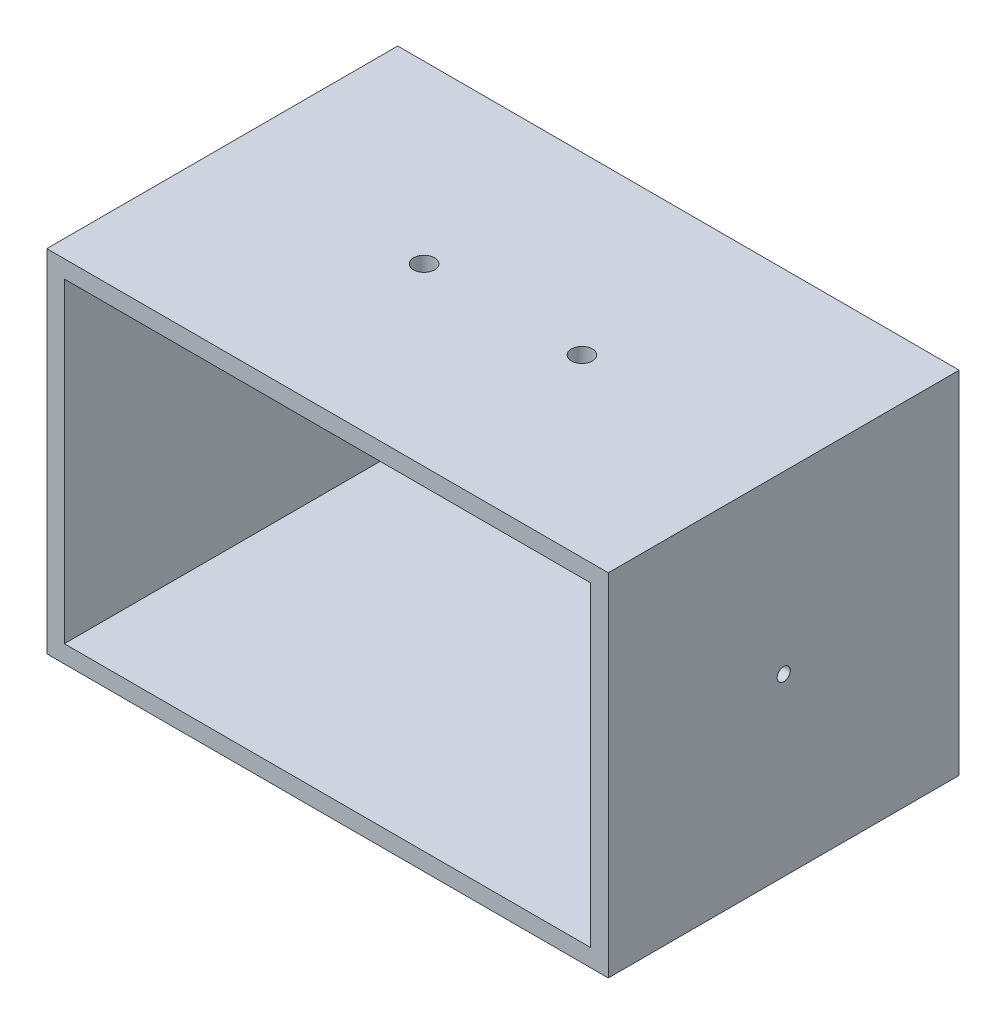
ISO-10303-21;
HEADER;
FILE_DESCRIPTION(('STEP AP214'),'2;1');
FILE_NAME('part.step','',(''),(''),'','','');
FILE_SCHEMA(('AUTOMOTIVE_DESIGN { 1 0 10303 214 1 1 1 1 }'));
ENDSEC;
DATA;
#1=APPLICATION_CONTEXT('core data for automotive mechanical design processes');
#2=APPLICATION_PROTOCOL_DEFINITION('international standard','automotive_design',2000,#1);
#3=PRODUCT_CONTEXT('',#1,'mechanical');
#4=PRODUCT('Part','Part','',(#3));
#5=PRODUCT_RELATED_PRODUCT_CATEGORY('part','',(#4));
#6=PRODUCT_DEFINITION_FORMATION('','',#4);
#7=PRODUCT_DEFINITION_CONTEXT('part definition',#1,'design');
#8=PRODUCT_DEFINITION('design','',#6,#7);
#9=PRODUCT_DEFINITION_SHAPE('','',#8);
#10=(LENGTH_UNIT() NAMED_UNIT(*) SI_UNIT(.MILLI.,.METRE.));
#11=(NAMED_UNIT(*) PLANE_ANGLE_UNIT() SI_UNIT($,.RADIAN.));
#12=(NAMED_UNIT(*) SI_UNIT($,.STERADIAN.) SOLID_ANGLE_UNIT());
#13=UNCERTAINTY_MEASURE_WITH_UNIT(LENGTH_MEASURE(1.E-05),#10,'distance_accuracy_value','');
#14=(GEOMETRIC_REPRESENTATION_CONTEXT(3) GLOBAL_UNCERTAINTY_ASSIGNED_CONTEXT((#13)) GLOBAL_UNIT_ASSIGNED_CONTEXT((#10,
#11,#12)) REPRESENTATION_CONTEXT('',''));
#15=CARTESIAN_POINT('',(0.,0.,0.));
#16=DIRECTION('',(0.,0.,1.));
#17=DIRECTION('',(1.,0.,0.));
#18=AXIS2_PLACEMENT_3D('',#15,#16,#17);
#19=CARTESIAN_POINT('',(0.,127.,0.));
#20=DIRECTION('',(0.,0.,-1.));
#21=DIRECTION('',(-1.,0.,0.));
#22=AXIS2_PLACEMENT_3D('',#19,#20,#21);
#23=PLANE('',#22);
#24=DIRECTION('',(1.,0.,0.));
#25=VECTOR('',#24,1.);
#26=CARTESIAN_POINT('',(0.,0.,0.));
#27=LINE('',#26,#25);
#28=CARTESIAN_POINT('',(0.,0.,0.));
#29=VERTEX_POINT('',#28);
#30=CARTESIAN_POINT('',(203.2,0.,0.));
#31=VERTEX_POINT('',#30);
#32=EDGE_CURVE('E167',#29,#31,#27,.T.);
#33=ORIENTED_EDGE('',*,*,#32,.T.);
#34=DIRECTION('',(0.,-1.,0.));
#35=VECTOR('',#34,1.);
#36=CARTESIAN_POINT('',(203.2,127.,0.));
#37=LINE('',#36,#35);
#38=CARTESIAN_POINT('',(203.2,127.,0.));
#39=VERTEX_POINT('',#38);
#40=EDGE_CURVE('E46',#39,#31,#37,.T.);
#41=ORIENTED_EDGE('',*,*,#40,.F.);
#42=DIRECTION('',(1.,0.,0.));
#43=VECTOR('',#42,1.);
#44=CARTESIAN_POINT('',(0.,127.,0.));
#45=LINE('',#44,#43);
#46=CARTESIAN_POINT('',(0.,127.,0.));
#47=VERTEX_POINT('',#46);
#48=EDGE_CURVE('E91',#47,#39,#45,.T.);
#49=ORIENTED_EDGE('',*,*,#48,.F.);
#50=DIRECTION('',(0.,-1.,0.));
#51=VECTOR('',#50,1.);
#52=CARTESIAN_POINT('',(0.,127.,0.));
#53=LINE('',#52,#51);
#54=EDGE_CURVE('E11',#47,#29,#53,.T.);
#55=ORIENTED_EDGE('',*,*,#54,.T.);
#56=EDGE_LOOP('',(#33,#41,#49,#55));
#57=FACE_BOUND('',#56,.T.);
#58=DIRECTION('',(1.,0.,0.));
#59=VECTOR('',#58,1.);
#60=CARTESIAN_POINT('',(0.,6.35,0.));
#61=LINE('',#60,#59);
#62=CARTESIAN_POINT('',(6.35,6.35,0.));
#63=VERTEX_POINT('',#62);
#64=CARTESIAN_POINT('',(196.85,6.35,0.));
#65=VERTEX_POINT('',#64);
#66=EDGE_CURVE('E135',#63,#65,#61,.T.);
#67=ORIENTED_EDGE('',*,*,#66,.F.);
#68=DIRECTION('',(0.,-1.,0.));
#69=VECTOR('',#68,1.);
#70=CARTESIAN_POINT('',(6.35,127.,0.));
#71=LINE('',#70,#69);
#72=CARTESIAN_POINT('',(6.35,120.65,0.));
#73=VERTEX_POINT('',#72);
#74=EDGE_CURVE('E134',#73,#63,#71,.T.);
#75=ORIENTED_EDGE('',*,*,#74,.F.);
#76=DIRECTION('',(1.,0.,0.));
#77=VECTOR('',#76,1.);
#78=CARTESIAN_POINT('',(0.,120.65,0.));
#79=LINE('',#78,#77);
#80=CARTESIAN_POINT('',(196.85,120.65,0.));
#81=VERTEX_POINT('',#80);
#82=EDGE_CURVE('E144',#73,#81,#79,.T.);
#83=ORIENTED_EDGE('',*,*,#82,.T.);
#84=DIRECTION('',(0.,-1.,0.));
#85=VECTOR('',#84,1.);
#86=CARTESIAN_POINT('',(196.85,127.,0.));
#87=LINE('',#86,#85);
#88=EDGE_CURVE('E149',#81,#65,#87,.T.);
#89=ORIENTED_EDGE('',*,*,#88,.T.);
#90=EDGE_LOOP('',(#67,#75,#83,#89));
#91=FACE_BOUND('',#90,.T.);
#92=ADVANCED_FACE('F37',(#57,#91),#23,.F.);
#93=CARTESIAN_POINT('',(0.,127.,0.));
#94=DIRECTION('',(1.,0.,0.));
#95=DIRECTION('',(0.,0.,-1.));
#96=AXIS2_PLACEMENT_3D('',#93,#94,#95);
#97=PLANE('',#96);
#98=CARTESIAN_POINT('',(0.,63.5,-63.5));
#99=DIRECTION('',(1.,0.,0.));
#100=DIRECTION('',(0.,0.,-1.));
#101=AXIS2_PLACEMENT_3D('',#98,#99,#100);
#102=CIRCLE('',#101,2.38125);
#103=CARTESIAN_POINT('',(0.,63.5,-65.88125));
#104=VERTEX_POINT('',#103);
#105=EDGE_CURVE('E178',#104,#104,#102,.T.);
#106=ORIENTED_EDGE('',*,*,#105,.T.);
#107=EDGE_LOOP('',(#106));
#108=FACE_BOUND('',#107,.T.);
#109=DIRECTION('',(0.,0.,1.));
#110=VECTOR('',#109,1.);
#111=CARTESIAN_POINT('',(0.,0.,0.));
#112=LINE('',#111,#110);
#113=CARTESIAN_POINT('',(0.,0.,-127.));
#114=VERTEX_POINT('',#113);
#115=EDGE_CURVE('E152',#114,#29,#112,.T.);
#116=ORIENTED_EDGE('',*,*,#115,.T.);
#117=ORIENTED_EDGE('',*,*,#54,.F.);
#118=DIRECTION('',(0.,0.,1.));
#119=VECTOR('',#118,1.);
#120=CARTESIAN_POINT('',(0.,127.,0.));
#121=LINE('',#120,#119);
#122=CARTESIAN_POINT('',(0.,127.,-127.));
#123=VERTEX_POINT('',#122);
#124=EDGE_CURVE('E158',#123,#47,#121,.T.);
#125=ORIENTED_EDGE('',*,*,#124,.F.);
#126=DIRECTION('',(0.,-1.,0.));
#127=VECTOR('',#126,1.);
#128=CARTESIAN_POINT('',(0.,127.,-127.));
#129=LINE('',#128,#127);
#130=EDGE_CURVE('E164',#123,#114,#129,.T.);
#131=ORIENTED_EDGE('',*,*,#130,.T.);
#132=EDGE_LOOP('',(#116,#117,#125,#131));
#133=FACE_BOUND('',#132,.T.);
#134=ADVANCED_FACE('F39',(#108,#133),#97,.F.);
#135=CARTESIAN_POINT('',(203.2,127.,0.));
#136=DIRECTION('',(-1.,0.,0.));
#137=DIRECTION('',(0.,0.,1.));
#138=AXIS2_PLACEMENT_3D('',#135,#136,#137);
#139=PLANE('',#138);
#140=CARTESIAN_POINT('',(203.2,63.5,-63.5));
#141=DIRECTION('',(1.,0.,0.));
#142=DIRECTION('',(0.,0.,-1.));
#143=AXIS2_PLACEMENT_3D('',#140,#141,#142);
#144=CIRCLE('',#143,2.38125);
#145=CARTESIAN_POINT('',(203.2,63.5,-65.88125));
#146=VERTEX_POINT('',#145);
#147=EDGE_CURVE('E185',#146,#146,#144,.T.);
#148=ORIENTED_EDGE('',*,*,#147,.F.);
#149=EDGE_LOOP('',(#148));
#150=FACE_BOUND('',#149,.T.);
#151=DIRECTION('',(0.,0.,-1.));
#152=VECTOR('',#151,1.);
#153=CARTESIAN_POINT('',(203.2,0.,0.));
#154=LINE('',#153,#152);
#155=CARTESIAN_POINT('',(203.2,0.,-127.));
#156=VERTEX_POINT('',#155);
#157=EDGE_CURVE('E169',#31,#156,#154,.T.);
#158=ORIENTED_EDGE('',*,*,#157,.T.);
#159=DIRECTION('',(0.,-1.,0.));
#160=VECTOR('',#159,1.);
#161=CARTESIAN_POINT('',(203.2,127.,-127.));
#162=LINE('',#161,#160);
#163=CARTESIAN_POINT('',(203.2,127.,-127.));
#164=VERTEX_POINT('',#163);
#165=EDGE_CURVE('E173',#164,#156,#162,.T.);
#166=ORIENTED_EDGE('',*,*,#165,.F.);
#167=DIRECTION('',(0.,0.,-1.));
#168=VECTOR('',#167,1.);
#169=CARTESIAN_POINT('',(203.2,127.,0.));
#170=LINE('',#169,#168);
#171=EDGE_CURVE('E161',#39,#164,#170,.T.);
#172=ORIENTED_EDGE('',*,*,#171,.F.);
#173=ORIENTED_EDGE('',*,*,#40,.T.);
#174=EDGE_LOOP('',(#158,#166,#172,#173));
#175=FACE_BOUND('',#174,.T.);
#176=ADVANCED_FACE('F200',(#150,#175),#139,.F.);
#177=CARTESIAN_POINT('',(0.,127.,-127.));
#178=DIRECTION('',(0.,0.,1.));
#179=DIRECTION('',(1.,0.,0.));
#180=AXIS2_PLACEMENT_3D('',#177,#178,#179);
#181=PLANE('',#180);
#182=DIRECTION('',(-1.,0.,0.));
#183=VECTOR('',#182,1.);
#184=CARTESIAN_POINT('',(0.,0.,-127.));
#185=LINE('',#184,#183);
#186=EDGE_CURVE('E84',#156,#114,#185,.T.);
#187=ORIENTED_EDGE('',*,*,#186,.T.);
#188=ORIENTED_EDGE('',*,*,#130,.F.);
#189=DIRECTION('',(-1.,0.,0.));
#190=VECTOR('',#189,1.);
#191=CARTESIAN_POINT('',(0.,127.,-127.));
#192=LINE('',#191,#190);
#193=EDGE_CURVE('E63',#164,#123,#192,.T.);
#194=ORIENTED_EDGE('',*,*,#193,.F.);
#195=ORIENTED_EDGE('',*,*,#165,.T.);
#196=EDGE_LOOP('',(#187,#188,#194,#195));
#197=FACE_BOUND('',#196,.T.);
#198=ADVANCED_FACE('F203',(#197),#181,.F.);
#199=CARTESIAN_POINT('',(0.,127.,0.));
#200=DIRECTION('',(0.,-1.,0.));
#201=DIRECTION('',(0.,0.,-1.));
#202=AXIS2_PLACEMENT_3D('',#199,#200,#201);
#203=PLANE('',#202);
#204=CARTESIAN_POINT('',(130.162737699088,127.,-63.5));
#205=DIRECTION('',(0.,1.,0.));
#206=DIRECTION('',(0.,0.,1.));
#207=AXIS2_PLACEMENT_3D('',#204,#205,#206);
#208=CIRCLE('',#207,3.79431201906751);
#209=CARTESIAN_POINT('',(130.162737699088,127.,-59.7056879809325));
#210=VERTEX_POINT('',#209);
#211=EDGE_CURVE('E181',#210,#210,#208,.T.);
#212=ORIENTED_EDGE('',*,*,#211,.F.);
#213=EDGE_LOOP('',(#212));
#214=FACE_BOUND('',#213,.T.);
#215=CARTESIAN_POINT('',(73.0372623009117,127.,-63.5));
#216=DIRECTION('',(0.,1.,0.));
#217=DIRECTION('',(0.,0.,1.));
#218=AXIS2_PLACEMENT_3D('',#215,#216,#217);
#219=CIRCLE('',#218,3.79431201906753);
#220=CARTESIAN_POINT('',(73.0372623009117,127.,-59.7056879809325));
#221=VERTEX_POINT('',#220);
#222=EDGE_CURVE('E187',#221,#221,#219,.T.);
#223=ORIENTED_EDGE('',*,*,#222,.F.);
#224=EDGE_LOOP('',(#223));
#225=FACE_BOUND('',#224,.T.);
#226=ORIENTED_EDGE('',*,*,#124,.T.);
#227=ORIENTED_EDGE('',*,*,#48,.T.);
#228=ORIENTED_EDGE('',*,*,#171,.T.);
#229=ORIENTED_EDGE('',*,*,#193,.T.);
#230=EDGE_LOOP('',(#226,#227,#228,#229));
#231=FACE_BOUND('',#230,.T.);
#232=ADVANCED_FACE('F214',(#214,#225,#231),#203,.F.);
#233=CARTESIAN_POINT('',(0.,0.,0.));
#234=DIRECTION('',(0.,-1.,0.));
#235=DIRECTION('',(0.,0.,-1.));
#236=AXIS2_PLACEMENT_3D('',#233,#234,#235);
#237=PLANE('',#236);
#238=ORIENTED_EDGE('',*,*,#115,.F.);
#239=ORIENTED_EDGE('',*,*,#186,.F.);
#240=ORIENTED_EDGE('',*,*,#157,.F.);
#241=ORIENTED_EDGE('',*,*,#32,.F.);
#242=EDGE_LOOP('',(#238,#239,#240,#241));
#243=FACE_BOUND('',#242,.T.);
#244=ADVANCED_FACE('F210',(#243),#237,.T.);
#245=CARTESIAN_POINT('',(6.35,127.,0.));
#246=DIRECTION('',(1.,0.,0.));
#247=DIRECTION('',(0.,0.,-1.));
#248=AXIS2_PLACEMENT_3D('',#245,#246,#247);
#249=PLANE('',#248);
#250=CARTESIAN_POINT('',(6.35,63.5,-63.5));
#251=DIRECTION('',(1.,0.,0.));
#252=DIRECTION('',(0.,0.,-1.));
#253=AXIS2_PLACEMENT_3D('',#250,#251,#252);
#254=CIRCLE('',#253,2.38125);
#255=CARTESIAN_POINT('',(6.35,63.5,-65.88125));
#256=VERTEX_POINT('',#255);
#257=EDGE_CURVE('E136',#256,#256,#254,.T.);
#258=ORIENTED_EDGE('',*,*,#257,.F.);
#259=EDGE_LOOP('',(#258));
#260=FACE_BOUND('',#259,.T.);
#261=DIRECTION('',(0.,0.,1.));
#262=VECTOR('',#261,1.);
#263=CARTESIAN_POINT('',(6.35,6.35,0.));
#264=LINE('',#263,#262);
#265=CARTESIAN_POINT('',(6.35,6.35,-120.65));
#266=VERTEX_POINT('',#265);
#267=EDGE_CURVE('E118',#266,#63,#264,.T.);
#268=ORIENTED_EDGE('',*,*,#267,.F.);
#269=DIRECTION('',(0.,-1.,0.));
#270=VECTOR('',#269,1.);
#271=CARTESIAN_POINT('',(6.35,127.,-120.65));
#272=LINE('',#271,#270);
#273=CARTESIAN_POINT('',(6.35,120.65,-120.65));
#274=VERTEX_POINT('',#273);
#275=EDGE_CURVE('E126',#274,#266,#272,.T.);
#276=ORIENTED_EDGE('',*,*,#275,.F.);
#277=DIRECTION('',(0.,0.,1.));
#278=VECTOR('',#277,1.);
#279=CARTESIAN_POINT('',(6.35,120.65,0.));
#280=LINE('',#279,#278);
#281=EDGE_CURVE('E54',#274,#73,#280,.T.);
#282=ORIENTED_EDGE('',*,*,#281,.T.);
#283=ORIENTED_EDGE('',*,*,#74,.T.);
#284=EDGE_LOOP('',(#268,#276,#282,#283));
#285=FACE_BOUND('',#284,.T.);
#286=ADVANCED_FACE('F132',(#260,#285),#249,.T.);
#287=CARTESIAN_POINT('',(196.85,127.,0.));
#288=DIRECTION('',(-1.,0.,0.));
#289=DIRECTION('',(0.,0.,1.));
#290=AXIS2_PLACEMENT_3D('',#287,#288,#289);
#291=PLANE('',#290);
#292=CARTESIAN_POINT('',(196.85,63.5,-63.5));
#293=DIRECTION('',(-1.,0.,0.));
#294=DIRECTION('',(0.,0.,1.));
#295=AXIS2_PLACEMENT_3D('',#292,#293,#294);
#296=CIRCLE('',#295,2.38125);
#297=CARTESIAN_POINT('',(196.85,63.5,-61.11875));
#298=VERTEX_POINT('',#297);
#299=EDGE_CURVE('E140',#298,#298,#296,.T.);
#300=ORIENTED_EDGE('',*,*,#299,.F.);
#301=EDGE_LOOP('',(#300));
#302=FACE_BOUND('',#301,.T.);
#303=DIRECTION('',(0.,0.,-1.));
#304=VECTOR('',#303,1.);
#305=CARTESIAN_POINT('',(196.85,6.35,0.));
#306=LINE('',#305,#304);
#307=CARTESIAN_POINT('',(196.85,6.35,-120.65));
#308=VERTEX_POINT('',#307);
#309=EDGE_CURVE('E121',#65,#308,#306,.T.);
#310=ORIENTED_EDGE('',*,*,#309,.F.);
#311=ORIENTED_EDGE('',*,*,#88,.F.);
#312=DIRECTION('',(0.,0.,-1.));
#313=VECTOR('',#312,1.);
#314=CARTESIAN_POINT('',(196.85,120.65,0.));
#315=LINE('',#314,#313);
#316=CARTESIAN_POINT('',(196.85,120.65,-120.65));
#317=VERTEX_POINT('',#316);
#318=EDGE_CURVE('E147',#81,#317,#315,.T.);
#319=ORIENTED_EDGE('',*,*,#318,.T.);
#320=DIRECTION('',(0.,-1.,0.));
#321=VECTOR('',#320,1.);
#322=CARTESIAN_POINT('',(196.85,127.,-120.65));
#323=LINE('',#322,#321);
#324=EDGE_CURVE('E130',#317,#308,#323,.T.);
#325=ORIENTED_EDGE('',*,*,#324,.T.);
#326=EDGE_LOOP('',(#310,#311,#319,#325));
#327=FACE_BOUND('',#326,.T.);
#328=ADVANCED_FACE('F218',(#302,#327),#291,.T.);
#329=CARTESIAN_POINT('',(0.,127.,-120.65));
#330=DIRECTION('',(0.,0.,1.));
#331=DIRECTION('',(1.,0.,0.));
#332=AXIS2_PLACEMENT_3D('',#329,#330,#331);
#333=PLANE('',#332);
#334=DIRECTION('',(-1.,0.,0.));
#335=VECTOR('',#334,1.);
#336=CARTESIAN_POINT('',(0.,6.35,-120.65));
#337=LINE('',#336,#335);
#338=EDGE_CURVE('E114',#308,#266,#337,.T.);
#339=ORIENTED_EDGE('',*,*,#338,.F.);
#340=ORIENTED_EDGE('',*,*,#324,.F.);
#341=DIRECTION('',(-1.,0.,0.));
#342=VECTOR('',#341,1.);
#343=CARTESIAN_POINT('',(0.,120.65,-120.65));
#344=LINE('',#343,#342);
#345=EDGE_CURVE('E129',#317,#274,#344,.T.);
#346=ORIENTED_EDGE('',*,*,#345,.T.);
#347=ORIENTED_EDGE('',*,*,#275,.T.);
#348=EDGE_LOOP('',(#339,#340,#346,#347));
#349=FACE_BOUND('',#348,.T.);
#350=ADVANCED_FACE('F127',(#349),#333,.T.);
#351=CARTESIAN_POINT('',(0.,120.65,0.));
#352=DIRECTION('',(0.,-1.,0.));
#353=DIRECTION('',(0.,0.,-1.));
#354=AXIS2_PLACEMENT_3D('',#351,#352,#353);
#355=PLANE('',#354);
#356=CARTESIAN_POINT('',(130.162737699088,120.65,-63.5));
#357=DIRECTION('',(0.,-1.,0.));
#358=DIRECTION('',(0.,0.,-1.));
#359=AXIS2_PLACEMENT_3D('',#356,#357,#358);
#360=CIRCLE('',#359,3.79431201906751);
#361=CARTESIAN_POINT('',(130.162737699088,120.65,-67.2943120190675));
#362=VERTEX_POINT('',#361);
#363=EDGE_CURVE('E41',#362,#362,#360,.T.);
#364=ORIENTED_EDGE('',*,*,#363,.F.);
#365=EDGE_LOOP('',(#364));
#366=FACE_BOUND('',#365,.T.);
#367=CARTESIAN_POINT('',(73.0372623009117,120.65,-63.5));
#368=DIRECTION('',(0.,-1.,0.));
#369=DIRECTION('',(0.,0.,-1.));
#370=AXIS2_PLACEMENT_3D('',#367,#368,#369);
#371=CIRCLE('',#370,3.79431201906753);
#372=CARTESIAN_POINT('',(73.0372623009117,120.65,-67.2943120190675));
#373=VERTEX_POINT('',#372);
#374=EDGE_CURVE('E179',#373,#373,#371,.T.);
#375=ORIENTED_EDGE('',*,*,#374,.F.);
#376=EDGE_LOOP('',(#375));
#377=FACE_BOUND('',#376,.T.);
#378=ORIENTED_EDGE('',*,*,#281,.F.);
#379=ORIENTED_EDGE('',*,*,#345,.F.);
#380=ORIENTED_EDGE('',*,*,#318,.F.);
#381=ORIENTED_EDGE('',*,*,#82,.F.);
#382=EDGE_LOOP('',(#378,#379,#380,#381));
#383=FACE_BOUND('',#382,.T.);
#384=ADVANCED_FACE('F221',(#366,#377,#383),#355,.T.);
#385=CARTESIAN_POINT('',(0.,6.35,0.));
#386=DIRECTION('',(0.,-1.,0.));
#387=DIRECTION('',(0.,0.,-1.));
#388=AXIS2_PLACEMENT_3D('',#385,#386,#387);
#389=PLANE('',#388);
#390=ORIENTED_EDGE('',*,*,#267,.T.);
#391=ORIENTED_EDGE('',*,*,#66,.T.);
#392=ORIENTED_EDGE('',*,*,#309,.T.);
#393=ORIENTED_EDGE('',*,*,#338,.T.);
#394=EDGE_LOOP('',(#390,#391,#392,#393));
#395=FACE_BOUND('',#394,.T.);
#396=ADVANCED_FACE('F116',(#395),#389,.F.);
#397=CARTESIAN_POINT('',(0.,63.5,-63.5));
#398=DIRECTION('',(1.,0.,0.));
#399=DIRECTION('',(0.,0.,-1.));
#400=AXIS2_PLACEMENT_3D('',#397,#398,#399);
#401=CYLINDRICAL_SURFACE('',#400,2.38125);
#402=ORIENTED_EDGE('',*,*,#299,.T.);
#403=EDGE_LOOP('',(#402));
#404=FACE_BOUND('',#403,.T.);
#405=ORIENTED_EDGE('',*,*,#147,.T.);
#406=EDGE_LOOP('',(#405));
#407=FACE_BOUND('',#406,.T.);
#408=ADVANCED_FACE('F198',(#404,#407),#401,.F.);
#409=ORIENTED_EDGE('',*,*,#257,.T.);
#410=EDGE_LOOP('',(#409));
#411=FACE_BOUND('',#410,.T.);
#412=ORIENTED_EDGE('',*,*,#105,.F.);
#413=EDGE_LOOP('',(#412));
#414=FACE_BOUND('',#413,.T.);
#415=ADVANCED_FACE('F315',(#411,#414),#401,.F.);
#416=CARTESIAN_POINT('',(73.0372623009117,103.632,-63.5));
#417=DIRECTION('',(0.,1.,0.));
#418=DIRECTION('',(0.,0.,1.));
#419=AXIS2_PLACEMENT_3D('',#416,#417,#418);
#420=CYLINDRICAL_SURFACE('',#419,3.79431201906753);
#421=ORIENTED_EDGE('',*,*,#374,.T.);
#422=EDGE_LOOP('',(#421));
#423=FACE_BOUND('',#422,.T.);
#424=ORIENTED_EDGE('',*,*,#222,.T.);
#425=EDGE_LOOP('',(#424));
#426=FACE_BOUND('',#425,.T.);
#427=ADVANCED_FACE('F317',(#423,#426),#420,.F.);
#428=CARTESIAN_POINT('',(130.162737699088,103.632,-63.5));
#429=DIRECTION('',(0.,1.,0.));
#430=DIRECTION('',(0.,0.,1.));
#431=AXIS2_PLACEMENT_3D('',#428,#429,#430);
#432=CYLINDRICAL_SURFACE('',#431,3.79431201906751);
#433=ORIENTED_EDGE('',*,*,#363,.T.);
#434=EDGE_LOOP('',(#433));
#435=FACE_BOUND('',#434,.T.);
#436=ORIENTED_EDGE('',*,*,#211,.T.);
#437=EDGE_LOOP('',(#436));
#438=FACE_BOUND('',#437,.T.);
#439=ADVANCED_FACE('F322',(#435,#438),#432,.F.);
#440=CLOSED_SHELL('',(#92,#134,#176,#198,#232,#244,#286,#328,#350,#384,#396,#408,#415,#427,#439));
#441=MANIFOLD_SOLID_BREP('B2',#440);
#442=ADVANCED_BREP_SHAPE_REPRESENTATION('',(#18,#441),#14);
#443=SHAPE_DEFINITION_REPRESENTATION(#9,#442);
ENDSEC;
END-ISO-10303-21;
